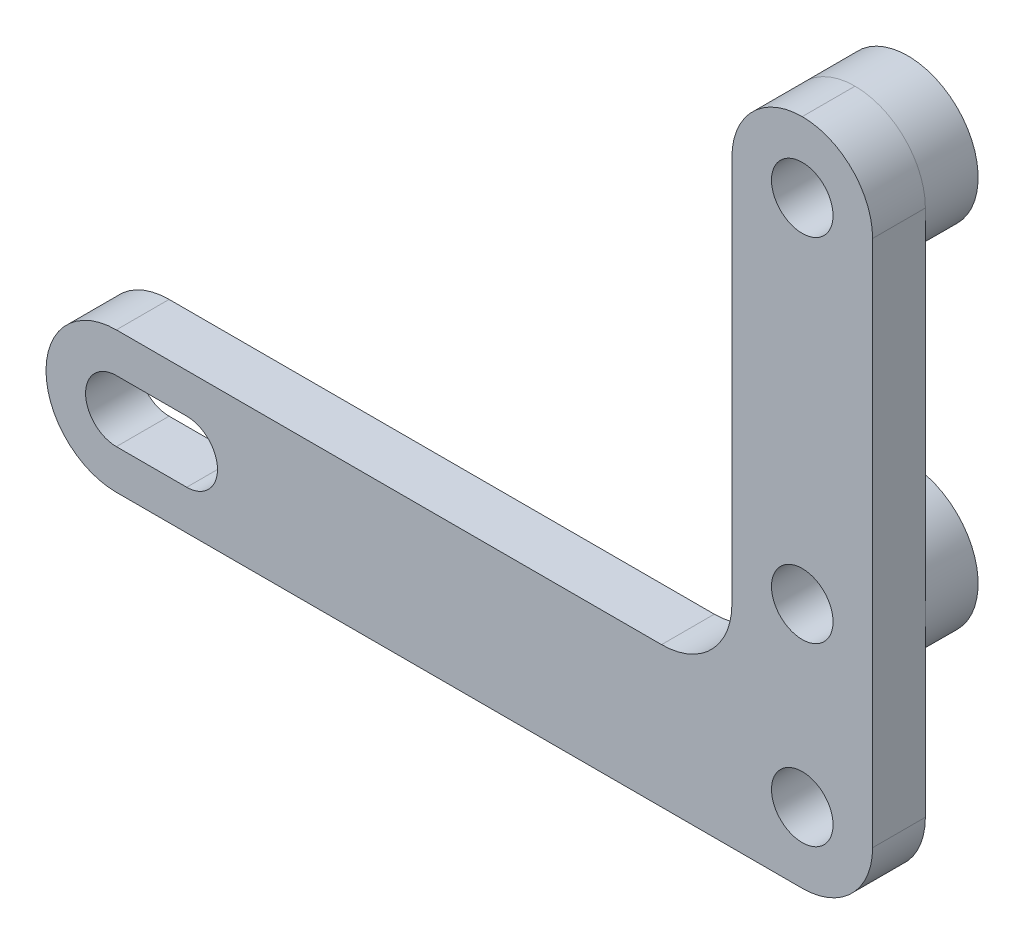
ISO-10303-21;
HEADER;
FILE_DESCRIPTION(('STEP AP214'),'2;1');
FILE_NAME('part.step','',(''),(''),'','','');
FILE_SCHEMA(('AUTOMOTIVE_DESIGN { 1 0 10303 214 1 1 1 1 }'));
ENDSEC;
DATA;
#1=APPLICATION_CONTEXT('core data for automotive mechanical design processes');
#2=APPLICATION_PROTOCOL_DEFINITION('international standard','automotive_design',2000,#1);
#3=PRODUCT_CONTEXT('',#1,'mechanical');
#4=PRODUCT('Part','Part','',(#3));
#5=PRODUCT_RELATED_PRODUCT_CATEGORY('part','',(#4));
#6=PRODUCT_DEFINITION_FORMATION('','',#4);
#7=PRODUCT_DEFINITION_CONTEXT('part definition',#1,'design');
#8=PRODUCT_DEFINITION('design','',#6,#7);
#9=PRODUCT_DEFINITION_SHAPE('','',#8);
#10=(LENGTH_UNIT() NAMED_UNIT(*) SI_UNIT(.MILLI.,.METRE.));
#11=(NAMED_UNIT(*) PLANE_ANGLE_UNIT() SI_UNIT($,.RADIAN.));
#12=(NAMED_UNIT(*) SI_UNIT($,.STERADIAN.) SOLID_ANGLE_UNIT());
#13=UNCERTAINTY_MEASURE_WITH_UNIT(LENGTH_MEASURE(1.E-05),#10,'distance_accuracy_value','');
#14=(GEOMETRIC_REPRESENTATION_CONTEXT(3) GLOBAL_UNCERTAINTY_ASSIGNED_CONTEXT((#13)) GLOBAL_UNIT_ASSIGNED_CONTEXT((#10,
#11,#12)) REPRESENTATION_CONTEXT('',''));
#15=CARTESIAN_POINT('',(0.,0.,0.));
#16=DIRECTION('',(0.,0.,1.));
#17=DIRECTION('',(1.,0.,0.));
#18=AXIS2_PLACEMENT_3D('',#15,#16,#17);
#19=CARTESIAN_POINT('',(0.,0.,0.));
#20=DIRECTION('',(0.,0.,1.));
#21=DIRECTION('',(1.,0.,0.));
#22=AXIS2_PLACEMENT_3D('',#19,#20,#21);
#23=PLANE('',#22);
#24=CARTESIAN_POINT('',(0.,0.,0.));
#25=DIRECTION('',(0.,0.,1.));
#26=DIRECTION('',(1.,0.,0.));
#27=AXIS2_PLACEMENT_3D('',#24,#25,#26);
#28=CIRCLE('',#27,1.75);
#29=CARTESIAN_POINT('',(1.75,0.,0.));
#30=VERTEX_POINT('',#29);
#31=EDGE_CURVE('E193',#30,#30,#28,.T.);
#32=ORIENTED_EDGE('',*,*,#31,.T.);
#33=EDGE_LOOP('',(#32));
#34=FACE_BOUND('',#33,.T.);
#35=CARTESIAN_POINT('',(-39.,0.,0.));
#36=DIRECTION('',(0.,0.,1.));
#37=DIRECTION('',(1.,0.,0.));
#38=AXIS2_PLACEMENT_3D('',#35,#36,#37);
#39=CIRCLE('',#38,1.75);
#40=CARTESIAN_POINT('',(-39.,1.75,0.));
#41=VERTEX_POINT('',#40);
#42=CARTESIAN_POINT('',(-39.,-1.75,0.));
#43=VERTEX_POINT('',#42);
#44=EDGE_CURVE('E197',#41,#43,#39,.T.);
#45=ORIENTED_EDGE('',*,*,#44,.T.);
#46=DIRECTION('',(1.,0.,0.));
#47=VECTOR('',#46,1.);
#48=CARTESIAN_POINT('',(-39.,-1.75,0.));
#49=LINE('',#48,#47);
#50=CARTESIAN_POINT('',(-35.,-1.75,0.));
#51=VERTEX_POINT('',#50);
#52=EDGE_CURVE('E213',#43,#51,#49,.T.);
#53=ORIENTED_EDGE('',*,*,#52,.T.);
#54=CARTESIAN_POINT('',(-35.,0.,0.));
#55=DIRECTION('',(0.,0.,1.));
#56=DIRECTION('',(1.,0.,0.));
#57=AXIS2_PLACEMENT_3D('',#54,#55,#56);
#58=CIRCLE('',#57,1.75);
#59=CARTESIAN_POINT('',(-35.,1.75,0.));
#60=VERTEX_POINT('',#59);
#61=EDGE_CURVE('E216',#51,#60,#58,.T.);
#62=ORIENTED_EDGE('',*,*,#61,.T.);
#63=DIRECTION('',(-1.,0.,0.));
#64=VECTOR('',#63,1.);
#65=CARTESIAN_POINT('',(-39.,1.75,0.));
#66=LINE('',#65,#64);
#67=EDGE_CURVE('E203',#60,#41,#66,.T.);
#68=ORIENTED_EDGE('',*,*,#67,.T.);
#69=EDGE_LOOP('',(#45,#53,#62,#68));
#70=FACE_BOUND('',#69,.T.);
#71=DIRECTION('',(0.,1.,0.));
#72=VECTOR('',#71,1.);
#73=CARTESIAN_POINT('',(4.,34.,0.));
#74=LINE('',#73,#72);
#75=CARTESIAN_POINT('',(4.,0.,0.));
#76=VERTEX_POINT('',#75);
#77=CARTESIAN_POINT('',(4.,10.,0.));
#78=VERTEX_POINT('',#77);
#79=EDGE_CURVE('E141',#76,#78,#74,.T.);
#80=ORIENTED_EDGE('',*,*,#79,.F.);
#81=CARTESIAN_POINT('',(0.,0.,0.));
#82=DIRECTION('',(0.,0.,1.));
#83=DIRECTION('',(1.,0.,0.));
#84=AXIS2_PLACEMENT_3D('',#81,#82,#83);
#85=CIRCLE('',#84,4.);
#86=CARTESIAN_POINT('',(0.,-4.,0.));
#87=VERTEX_POINT('',#86);
#88=EDGE_CURVE('E262',#76,#87,#85,.F.);
#89=ORIENTED_EDGE('',*,*,#88,.T.);
#90=DIRECTION('',(1.,0.,0.));
#91=VECTOR('',#90,1.);
#92=CARTESIAN_POINT('',(4.,-4.,0.));
#93=LINE('',#92,#91);
#94=CARTESIAN_POINT('',(-39.,-4.,0.));
#95=VERTEX_POINT('',#94);
#96=EDGE_CURVE('E163',#95,#87,#93,.T.);
#97=ORIENTED_EDGE('',*,*,#96,.F.);
#98=CARTESIAN_POINT('',(-39.,0.,0.));
#99=DIRECTION('',(0.,0.,1.));
#100=DIRECTION('',(1.,0.,0.));
#101=AXIS2_PLACEMENT_3D('',#98,#99,#100);
#102=CIRCLE('',#101,4.);
#103=CARTESIAN_POINT('',(-43.,0.,0.));
#104=VERTEX_POINT('',#103);
#105=EDGE_CURVE('E260',#95,#104,#102,.F.);
#106=ORIENTED_EDGE('',*,*,#105,.T.);
#107=CARTESIAN_POINT('',(-39.,0.,0.));
#108=DIRECTION('',(0.,0.,1.));
#109=DIRECTION('',(1.,0.,0.));
#110=AXIS2_PLACEMENT_3D('',#107,#108,#109);
#111=CIRCLE('',#110,4.);
#112=CARTESIAN_POINT('',(-39.,4.,0.));
#113=VERTEX_POINT('',#112);
#114=EDGE_CURVE('E258',#104,#113,#111,.F.);
#115=ORIENTED_EDGE('',*,*,#114,.T.);
#116=DIRECTION('',(-1.,0.,0.));
#117=VECTOR('',#116,1.);
#118=CARTESIAN_POINT('',(-43.,4.,0.));
#119=LINE('',#118,#117);
#120=CARTESIAN_POINT('',(-8.,4.,0.));
#121=VERTEX_POINT('',#120);
#122=EDGE_CURVE('E241',#121,#113,#119,.T.);
#123=ORIENTED_EDGE('',*,*,#122,.F.);
#124=CARTESIAN_POINT('',(-8.,8.,0.));
#125=DIRECTION('',(0.,0.,1.));
#126=DIRECTION('',(1.,0.,0.));
#127=AXIS2_PLACEMENT_3D('',#124,#125,#126);
#128=CIRCLE('',#127,4.);
#129=CARTESIAN_POINT('',(-4.,8.00000000000001,0.));
#130=VERTEX_POINT('',#129);
#131=EDGE_CURVE('E42',#121,#130,#128,.T.);
#132=ORIENTED_EDGE('',*,*,#131,.T.);
#133=DIRECTION('',(0.,-1.,0.));
#134=VECTOR('',#133,1.);
#135=CARTESIAN_POINT('',(-4.,34.,0.));
#136=LINE('',#135,#134);
#137=CARTESIAN_POINT('',(-4.,10.,0.));
#138=VERTEX_POINT('',#137);
#139=EDGE_CURVE('E167',#138,#130,#136,.T.);
#140=ORIENTED_EDGE('',*,*,#139,.F.);
#141=CARTESIAN_POINT('',(0.,10.,0.));
#142=DIRECTION('',(0.,0.,-1.));
#143=DIRECTION('',(-1.,0.,0.));
#144=AXIS2_PLACEMENT_3D('',#141,#142,#143);
#145=CIRCLE('',#144,4.);
#146=EDGE_CURVE('E165',#78,#138,#145,.T.);
#147=ORIENTED_EDGE('',*,*,#146,.F.);
#148=EDGE_LOOP('',(#80,#89,#97,#106,#115,#123,#132,#140,#147));
#149=FACE_BOUND('',#148,.T.);
#150=ADVANCED_FACE('F33',(#34,#70,#149),#23,.F.);
#151=EDGE_CURVE('E158',#138,#78,#145,.T.);
#152=ORIENTED_EDGE('',*,*,#151,.F.);
#153=CARTESIAN_POINT('',(-4.,30.,0.));
#154=VERTEX_POINT('',#153);
#155=EDGE_CURVE('E240',#154,#138,#136,.T.);
#156=ORIENTED_EDGE('',*,*,#155,.F.);
#157=CARTESIAN_POINT('',(0.,30.,0.));
#158=DIRECTION('',(0.,0.,-1.));
#159=DIRECTION('',(-1.,0.,0.));
#160=AXIS2_PLACEMENT_3D('',#157,#158,#159);
#161=CIRCLE('',#160,4.);
#162=CARTESIAN_POINT('',(4.,30.,0.));
#163=VERTEX_POINT('',#162);
#164=EDGE_CURVE('E161',#163,#154,#161,.T.);
#165=ORIENTED_EDGE('',*,*,#164,.F.);
#166=EDGE_CURVE('E146',#78,#163,#74,.T.);
#167=ORIENTED_EDGE('',*,*,#166,.F.);
#168=EDGE_LOOP('',(#152,#156,#165,#167));
#169=FACE_BOUND('',#168,.T.);
#170=ADVANCED_FACE('F155',(#169),#23,.F.);
#171=CARTESIAN_POINT('',(0.,0.,3.));
#172=DIRECTION('',(0.,0.,1.));
#173=DIRECTION('',(1.,0.,0.));
#174=AXIS2_PLACEMENT_3D('',#171,#172,#173);
#175=PLANE('',#174);
#176=CARTESIAN_POINT('',(0.,30.,3.));
#177=DIRECTION('',(0.,0.,1.));
#178=DIRECTION('',(1.,0.,0.));
#179=AXIS2_PLACEMENT_3D('',#176,#177,#178);
#180=CIRCLE('',#179,1.75);
#181=CARTESIAN_POINT('',(1.75,30.,3.));
#182=VERTEX_POINT('',#181);
#183=EDGE_CURVE('E190',#182,#182,#180,.T.);
#184=ORIENTED_EDGE('',*,*,#183,.F.);
#185=EDGE_LOOP('',(#184));
#186=FACE_BOUND('',#185,.T.);
#187=DIRECTION('',(1.,0.,0.));
#188=VECTOR('',#187,1.);
#189=CARTESIAN_POINT('',(-39.,-1.75,3.));
#190=LINE('',#189,#188);
#191=CARTESIAN_POINT('',(-39.,-1.75,3.));
#192=VERTEX_POINT('',#191);
#193=CARTESIAN_POINT('',(-35.,-1.75,3.));
#194=VERTEX_POINT('',#193);
#195=EDGE_CURVE('E202',#192,#194,#190,.T.);
#196=ORIENTED_EDGE('',*,*,#195,.F.);
#197=CARTESIAN_POINT('',(-39.,0.,3.));
#198=DIRECTION('',(0.,0.,1.));
#199=DIRECTION('',(1.,0.,0.));
#200=AXIS2_PLACEMENT_3D('',#197,#198,#199);
#201=CIRCLE('',#200,1.75);
#202=CARTESIAN_POINT('',(-39.,1.75,3.));
#203=VERTEX_POINT('',#202);
#204=EDGE_CURVE('E200',#203,#192,#201,.T.);
#205=ORIENTED_EDGE('',*,*,#204,.F.);
#206=DIRECTION('',(-1.,0.,0.));
#207=VECTOR('',#206,1.);
#208=CARTESIAN_POINT('',(-39.,1.75,3.));
#209=LINE('',#208,#207);
#210=CARTESIAN_POINT('',(-35.,1.75,3.));
#211=VERTEX_POINT('',#210);
#212=EDGE_CURVE('E208',#211,#203,#209,.T.);
#213=ORIENTED_EDGE('',*,*,#212,.F.);
#214=CARTESIAN_POINT('',(-35.,0.,3.));
#215=DIRECTION('',(0.,0.,1.));
#216=DIRECTION('',(1.,0.,0.));
#217=AXIS2_PLACEMENT_3D('',#214,#215,#216);
#218=CIRCLE('',#217,1.75);
#219=EDGE_CURVE('E205',#194,#211,#218,.T.);
#220=ORIENTED_EDGE('',*,*,#219,.F.);
#221=EDGE_LOOP('',(#196,#205,#213,#220));
#222=FACE_BOUND('',#221,.T.);
#223=DIRECTION('',(1.,0.,0.));
#224=VECTOR('',#223,1.);
#225=CARTESIAN_POINT('',(4.,-4.,3.));
#226=LINE('',#225,#224);
#227=CARTESIAN_POINT('',(-39.,-4.,3.));
#228=VERTEX_POINT('',#227);
#229=CARTESIAN_POINT('',(0.,-4.,3.));
#230=VERTEX_POINT('',#229);
#231=EDGE_CURVE('E234',#228,#230,#226,.T.);
#232=ORIENTED_EDGE('',*,*,#231,.T.);
#233=CARTESIAN_POINT('',(0.,0.,3.));
#234=DIRECTION('',(0.,0.,1.));
#235=DIRECTION('',(1.,0.,0.));
#236=AXIS2_PLACEMENT_3D('',#233,#234,#235);
#237=CIRCLE('',#236,4.);
#238=CARTESIAN_POINT('',(4.,0.,3.));
#239=VERTEX_POINT('',#238);
#240=EDGE_CURVE('E275',#230,#239,#237,.T.);
#241=ORIENTED_EDGE('',*,*,#240,.T.);
#242=DIRECTION('',(0.,1.,0.));
#243=VECTOR('',#242,1.);
#244=CARTESIAN_POINT('',(4.,34.,3.));
#245=LINE('',#244,#243);
#246=CARTESIAN_POINT('',(4.,30.,3.));
#247=VERTEX_POINT('',#246);
#248=EDGE_CURVE('E237',#239,#247,#245,.T.);
#249=ORIENTED_EDGE('',*,*,#248,.T.);
#250=CARTESIAN_POINT('',(0.,30.,3.));
#251=DIRECTION('',(0.,0.,1.));
#252=DIRECTION('',(1.,0.,0.));
#253=AXIS2_PLACEMENT_3D('',#250,#251,#252);
#254=CIRCLE('',#253,4.);
#255=CARTESIAN_POINT('',(0.,34.,3.));
#256=VERTEX_POINT('',#255);
#257=EDGE_CURVE('E50',#247,#256,#254,.T.);
#258=ORIENTED_EDGE('',*,*,#257,.T.);
#259=CARTESIAN_POINT('',(0.,30.,3.));
#260=DIRECTION('',(0.,0.,1.));
#261=DIRECTION('',(1.,0.,0.));
#262=AXIS2_PLACEMENT_3D('',#259,#260,#261);
#263=CIRCLE('',#262,4.);
#264=CARTESIAN_POINT('',(-4.,30.,3.));
#265=VERTEX_POINT('',#264);
#266=EDGE_CURVE('E269',#256,#265,#263,.T.);
#267=ORIENTED_EDGE('',*,*,#266,.T.);
#268=DIRECTION('',(0.,-1.,0.));
#269=VECTOR('',#268,1.);
#270=CARTESIAN_POINT('',(-4.,34.,3.));
#271=LINE('',#270,#269);
#272=CARTESIAN_POINT('',(-4.,8.00000000000001,3.));
#273=VERTEX_POINT('',#272);
#274=EDGE_CURVE('E152',#265,#273,#271,.T.);
#275=ORIENTED_EDGE('',*,*,#274,.T.);
#276=CARTESIAN_POINT('',(-8.,8.,3.));
#277=DIRECTION('',(0.,0.,1.));
#278=DIRECTION('',(1.,0.,0.));
#279=AXIS2_PLACEMENT_3D('',#276,#277,#278);
#280=CIRCLE('',#279,4.);
#281=CARTESIAN_POINT('',(-8.,4.,3.));
#282=VERTEX_POINT('',#281);
#283=EDGE_CURVE('E11',#273,#282,#280,.F.);
#284=ORIENTED_EDGE('',*,*,#283,.T.);
#285=DIRECTION('',(-1.,0.,0.));
#286=VECTOR('',#285,1.);
#287=CARTESIAN_POINT('',(-43.,4.,3.));
#288=LINE('',#287,#286);
#289=CARTESIAN_POINT('',(-39.,4.,3.));
#290=VERTEX_POINT('',#289);
#291=EDGE_CURVE('E232',#282,#290,#288,.T.);
#292=ORIENTED_EDGE('',*,*,#291,.T.);
#293=CARTESIAN_POINT('',(-39.,0.,3.));
#294=DIRECTION('',(0.,0.,1.));
#295=DIRECTION('',(1.,0.,0.));
#296=AXIS2_PLACEMENT_3D('',#293,#294,#295);
#297=CIRCLE('',#296,4.);
#298=CARTESIAN_POINT('',(-43.,0.,3.));
#299=VERTEX_POINT('',#298);
#300=EDGE_CURVE('E57',#290,#299,#297,.T.);
#301=ORIENTED_EDGE('',*,*,#300,.T.);
#302=CARTESIAN_POINT('',(-39.,0.,3.));
#303=DIRECTION('',(0.,0.,1.));
#304=DIRECTION('',(1.,0.,0.));
#305=AXIS2_PLACEMENT_3D('',#302,#303,#304);
#306=CIRCLE('',#305,4.);
#307=EDGE_CURVE('E273',#299,#228,#306,.T.);
#308=ORIENTED_EDGE('',*,*,#307,.T.);
#309=EDGE_LOOP('',(#232,#241,#249,#258,#267,#275,#284,#292,#301,#308));
#310=FACE_BOUND('',#309,.T.);
#311=CARTESIAN_POINT('',(0.,0.,3.));
#312=DIRECTION('',(0.,0.,1.));
#313=DIRECTION('',(1.,0.,0.));
#314=AXIS2_PLACEMENT_3D('',#311,#312,#313);
#315=CIRCLE('',#314,1.75);
#316=CARTESIAN_POINT('',(1.75,0.,3.));
#317=VERTEX_POINT('',#316);
#318=EDGE_CURVE('E194',#317,#317,#315,.T.);
#319=ORIENTED_EDGE('',*,*,#318,.F.);
#320=EDGE_LOOP('',(#319));
#321=FACE_BOUND('',#320,.T.);
#322=CARTESIAN_POINT('',(0.,10.,3.));
#323=DIRECTION('',(0.,0.,1.));
#324=DIRECTION('',(1.,0.,0.));
#325=AXIS2_PLACEMENT_3D('',#322,#323,#324);
#326=CIRCLE('',#325,1.75);
#327=CARTESIAN_POINT('',(1.75,10.,3.));
#328=VERTEX_POINT('',#327);
#329=EDGE_CURVE('E185',#328,#328,#326,.T.);
#330=ORIENTED_EDGE('',*,*,#329,.F.);
#331=EDGE_LOOP('',(#330));
#332=FACE_BOUND('',#331,.T.);
#333=ADVANCED_FACE('F292',(#186,#222,#310,#321,#332),#175,.T.);
#334=CARTESIAN_POINT('',(-4.,34.,3.));
#335=DIRECTION('',(1.,0.,0.));
#336=DIRECTION('',(0.,1.,0.));
#337=AXIS2_PLACEMENT_3D('',#334,#335,#336);
#338=PLANE('',#337);
#339=ORIENTED_EDGE('',*,*,#139,.T.);
#340=DIRECTION('',(0.,0.,-1.));
#341=VECTOR('',#340,1.);
#342=CARTESIAN_POINT('',(-4.,8.,3.));
#343=LINE('',#342,#341);
#344=EDGE_CURVE('E253',#130,#273,#343,.F.);
#345=ORIENTED_EDGE('',*,*,#344,.T.);
#346=ORIENTED_EDGE('',*,*,#274,.F.);
#347=DIRECTION('',(0.,0.,-1.));
#348=VECTOR('',#347,1.);
#349=CARTESIAN_POINT('',(-4.,30.,3.));
#350=LINE('',#349,#348);
#351=EDGE_CURVE('E251',#265,#154,#350,.T.);
#352=ORIENTED_EDGE('',*,*,#351,.T.);
#353=ORIENTED_EDGE('',*,*,#155,.T.);
#354=EDGE_LOOP('',(#339,#345,#346,#352,#353));
#355=FACE_BOUND('',#354,.T.);
#356=ADVANCED_FACE('F296',(#355),#338,.F.);
#357=CARTESIAN_POINT('',(-43.,4.,3.));
#358=DIRECTION('',(0.,-1.,0.));
#359=DIRECTION('',(0.,0.,-1.));
#360=AXIS2_PLACEMENT_3D('',#357,#358,#359);
#361=PLANE('',#360);
#362=ORIENTED_EDGE('',*,*,#291,.F.);
#363=DIRECTION('',(0.,0.,-1.));
#364=VECTOR('',#363,1.);
#365=CARTESIAN_POINT('',(-8.,4.,0.));
#366=LINE('',#365,#364);
#367=EDGE_CURVE('E248',#282,#121,#366,.T.);
#368=ORIENTED_EDGE('',*,*,#367,.T.);
#369=ORIENTED_EDGE('',*,*,#122,.T.);
#370=DIRECTION('',(0.,0.,-1.));
#371=VECTOR('',#370,1.);
#372=CARTESIAN_POINT('',(-39.,4.,3.));
#373=LINE('',#372,#371);
#374=EDGE_CURVE('E246',#113,#290,#373,.F.);
#375=ORIENTED_EDGE('',*,*,#374,.T.);
#376=EDGE_LOOP('',(#362,#368,#369,#375));
#377=FACE_BOUND('',#376,.T.);
#378=ADVANCED_FACE('F303',(#377),#361,.F.);
#379=CARTESIAN_POINT('',(4.,-4.,3.));
#380=DIRECTION('',(0.,1.,0.));
#381=DIRECTION('',(0.,0.,1.));
#382=AXIS2_PLACEMENT_3D('',#379,#380,#381);
#383=PLANE('',#382);
#384=ORIENTED_EDGE('',*,*,#96,.T.);
#385=DIRECTION('',(0.,0.,-1.));
#386=VECTOR('',#385,1.);
#387=CARTESIAN_POINT('',(0.,-4.,3.));
#388=LINE('',#387,#386);
#389=EDGE_CURVE('E267',#87,#230,#388,.F.);
#390=ORIENTED_EDGE('',*,*,#389,.T.);
#391=ORIENTED_EDGE('',*,*,#231,.F.);
#392=DIRECTION('',(0.,0.,-1.));
#393=VECTOR('',#392,1.);
#394=CARTESIAN_POINT('',(-39.,-4.,3.));
#395=LINE('',#394,#393);
#396=EDGE_CURVE('E264',#228,#95,#395,.T.);
#397=ORIENTED_EDGE('',*,*,#396,.T.);
#398=EDGE_LOOP('',(#384,#390,#391,#397));
#399=FACE_BOUND('',#398,.T.);
#400=ADVANCED_FACE('F314',(#399),#383,.F.);
#401=CARTESIAN_POINT('',(4.,34.,3.));
#402=DIRECTION('',(-1.,0.,0.));
#403=DIRECTION('',(0.,-1.,0.));
#404=AXIS2_PLACEMENT_3D('',#401,#402,#403);
#405=PLANE('',#404);
#406=ORIENTED_EDGE('',*,*,#248,.F.);
#407=DIRECTION('',(0.,0.,-1.));
#408=VECTOR('',#407,1.);
#409=CARTESIAN_POINT('',(4.,0.,3.));
#410=LINE('',#409,#408);
#411=EDGE_CURVE('E149',#239,#76,#410,.T.);
#412=ORIENTED_EDGE('',*,*,#411,.T.);
#413=ORIENTED_EDGE('',*,*,#79,.T.);
#414=ORIENTED_EDGE('',*,*,#166,.T.);
#415=DIRECTION('',(0.,0.,-1.));
#416=VECTOR('',#415,1.);
#417=CARTESIAN_POINT('',(4.,30.,3.));
#418=LINE('',#417,#416);
#419=EDGE_CURVE('E255',#163,#247,#418,.F.);
#420=ORIENTED_EDGE('',*,*,#419,.T.);
#421=EDGE_LOOP('',(#406,#412,#413,#414,#420));
#422=FACE_BOUND('',#421,.T.);
#423=ADVANCED_FACE('F144',(#422),#405,.F.);
#424=CARTESIAN_POINT('',(-39.,0.,3.));
#425=DIRECTION('',(0.,0.,-1.));
#426=DIRECTION('',(-1.,0.,0.));
#427=AXIS2_PLACEMENT_3D('',#424,#425,#426);
#428=CYLINDRICAL_SURFACE('',#427,1.75);
#429=ORIENTED_EDGE('',*,*,#44,.F.);
#430=DIRECTION('',(0.,0.,-1.));
#431=VECTOR('',#430,1.);
#432=CARTESIAN_POINT('',(-39.,1.75,3.));
#433=LINE('',#432,#431);
#434=EDGE_CURVE('E210',#203,#41,#433,.T.);
#435=ORIENTED_EDGE('',*,*,#434,.F.);
#436=ORIENTED_EDGE('',*,*,#204,.T.);
#437=DIRECTION('',(0.,0.,-1.));
#438=VECTOR('',#437,1.);
#439=CARTESIAN_POINT('',(-39.,-1.75,3.));
#440=LINE('',#439,#438);
#441=EDGE_CURVE('E227',#192,#43,#440,.T.);
#442=ORIENTED_EDGE('',*,*,#441,.T.);
#443=EDGE_LOOP('',(#429,#435,#436,#442));
#444=FACE_BOUND('',#443,.T.);
#445=ADVANCED_FACE('F340',(#444),#428,.F.);
#446=CARTESIAN_POINT('',(-39.,-1.75,3.));
#447=DIRECTION('',(0.,1.,0.));
#448=DIRECTION('',(0.,0.,1.));
#449=AXIS2_PLACEMENT_3D('',#446,#447,#448);
#450=PLANE('',#449);
#451=ORIENTED_EDGE('',*,*,#52,.F.);
#452=ORIENTED_EDGE('',*,*,#441,.F.);
#453=ORIENTED_EDGE('',*,*,#195,.T.);
#454=DIRECTION('',(0.,0.,-1.));
#455=VECTOR('',#454,1.);
#456=CARTESIAN_POINT('',(-35.,-1.75,3.));
#457=LINE('',#456,#455);
#458=EDGE_CURVE('E225',#194,#51,#457,.T.);
#459=ORIENTED_EDGE('',*,*,#458,.T.);
#460=EDGE_LOOP('',(#451,#452,#453,#459));
#461=FACE_BOUND('',#460,.T.);
#462=ADVANCED_FACE('F361',(#461),#450,.T.);
#463=CARTESIAN_POINT('',(-35.,0.,3.));
#464=DIRECTION('',(0.,0.,-1.));
#465=DIRECTION('',(-1.,0.,0.));
#466=AXIS2_PLACEMENT_3D('',#463,#464,#465);
#467=CYLINDRICAL_SURFACE('',#466,1.75);
#468=ORIENTED_EDGE('',*,*,#61,.F.);
#469=ORIENTED_EDGE('',*,*,#458,.F.);
#470=ORIENTED_EDGE('',*,*,#219,.T.);
#471=DIRECTION('',(0.,0.,-1.));
#472=VECTOR('',#471,1.);
#473=CARTESIAN_POINT('',(-35.,1.75,3.));
#474=LINE('',#473,#472);
#475=EDGE_CURVE('E223',#211,#60,#474,.T.);
#476=ORIENTED_EDGE('',*,*,#475,.T.);
#477=EDGE_LOOP('',(#468,#469,#470,#476));
#478=FACE_BOUND('',#477,.T.);
#479=ADVANCED_FACE('F364',(#478),#467,.F.);
#480=CARTESIAN_POINT('',(-39.,1.75,3.));
#481=DIRECTION('',(0.,-1.,0.));
#482=DIRECTION('',(0.,0.,-1.));
#483=AXIS2_PLACEMENT_3D('',#480,#481,#482);
#484=PLANE('',#483);
#485=ORIENTED_EDGE('',*,*,#67,.F.);
#486=ORIENTED_EDGE('',*,*,#475,.F.);
#487=ORIENTED_EDGE('',*,*,#212,.T.);
#488=ORIENTED_EDGE('',*,*,#434,.T.);
#489=EDGE_LOOP('',(#485,#486,#487,#488));
#490=FACE_BOUND('',#489,.T.);
#491=ADVANCED_FACE('F369',(#490),#484,.T.);
#492=CARTESIAN_POINT('',(0.,0.,3.));
#493=DIRECTION('',(0.,0.,-1.));
#494=DIRECTION('',(-1.,0.,0.));
#495=AXIS2_PLACEMENT_3D('',#492,#493,#494);
#496=CYLINDRICAL_SURFACE('',#495,1.75);
#497=ORIENTED_EDGE('',*,*,#318,.T.);
#498=EDGE_LOOP('',(#497));
#499=FACE_BOUND('',#498,.T.);
#500=ORIENTED_EDGE('',*,*,#31,.F.);
#501=EDGE_LOOP('',(#500));
#502=FACE_BOUND('',#501,.T.);
#503=ADVANCED_FACE('F371',(#499,#502),#496,.F.);
#504=CARTESIAN_POINT('',(0.,30.,3.));
#505=DIRECTION('',(0.,0.,-1.));
#506=DIRECTION('',(-1.,0.,0.));
#507=AXIS2_PLACEMENT_3D('',#504,#505,#506);
#508=CYLINDRICAL_SURFACE('',#507,1.75);
#509=ORIENTED_EDGE('',*,*,#183,.T.);
#510=EDGE_LOOP('',(#509));
#511=FACE_BOUND('',#510,.T.);
#512=CARTESIAN_POINT('',(0.,30.,-3.));
#513=DIRECTION('',(0.,0.,-1.));
#514=DIRECTION('',(-1.,0.,0.));
#515=AXIS2_PLACEMENT_3D('',#512,#513,#514);
#516=CIRCLE('',#515,1.75);
#517=CARTESIAN_POINT('',(-1.75,30.,-3.));
#518=VERTEX_POINT('',#517);
#519=EDGE_CURVE('E175',#518,#518,#516,.T.);
#520=ORIENTED_EDGE('',*,*,#519,.T.);
#521=EDGE_LOOP('',(#520));
#522=FACE_BOUND('',#521,.T.);
#523=ADVANCED_FACE('F377',(#511,#522),#508,.F.);
#524=CARTESIAN_POINT('',(0.,10.,3.));
#525=DIRECTION('',(0.,0.,-1.));
#526=DIRECTION('',(-1.,0.,0.));
#527=AXIS2_PLACEMENT_3D('',#524,#525,#526);
#528=CYLINDRICAL_SURFACE('',#527,1.75);
#529=ORIENTED_EDGE('',*,*,#329,.T.);
#530=EDGE_LOOP('',(#529));
#531=FACE_BOUND('',#530,.T.);
#532=CARTESIAN_POINT('',(0.,10.,-3.));
#533=DIRECTION('',(0.,0.,-1.));
#534=DIRECTION('',(-1.,0.,0.));
#535=AXIS2_PLACEMENT_3D('',#532,#533,#534);
#536=CIRCLE('',#535,1.75);
#537=CARTESIAN_POINT('',(-1.75,10.,-3.));
#538=VERTEX_POINT('',#537);
#539=EDGE_CURVE('E170',#538,#538,#536,.T.);
#540=ORIENTED_EDGE('',*,*,#539,.T.);
#541=EDGE_LOOP('',(#540));
#542=FACE_BOUND('',#541,.T.);
#543=ADVANCED_FACE('F417',(#531,#542),#528,.F.);
#544=CARTESIAN_POINT('',(0.,30.,-3.));
#545=DIRECTION('',(0.,0.,-1.));
#546=DIRECTION('',(-1.,0.,0.));
#547=AXIS2_PLACEMENT_3D('',#544,#545,#546);
#548=PLANE('',#547);
#549=CARTESIAN_POINT('',(0.,30.,-3.));
#550=DIRECTION('',(0.,0.,-1.));
#551=DIRECTION('',(-1.,0.,0.));
#552=AXIS2_PLACEMENT_3D('',#549,#550,#551);
#553=CIRCLE('',#552,4.);
#554=CARTESIAN_POINT('',(-4.,30.,-3.));
#555=VERTEX_POINT('',#554);
#556=EDGE_CURVE('E182',#555,#555,#553,.T.);
#557=ORIENTED_EDGE('',*,*,#556,.T.);
#558=EDGE_LOOP('',(#557));
#559=FACE_BOUND('',#558,.T.);
#560=ORIENTED_EDGE('',*,*,#519,.F.);
#561=EDGE_LOOP('',(#560));
#562=FACE_BOUND('',#561,.T.);
#563=ADVANCED_FACE('F427',(#559,#562),#548,.T.);
#564=CARTESIAN_POINT('',(0.,30.,-3.));
#565=DIRECTION('',(0.,0.,1.));
#566=DIRECTION('',(1.,0.,0.));
#567=AXIS2_PLACEMENT_3D('',#564,#565,#566);
#568=CYLINDRICAL_SURFACE('',#567,4.);
#569=ORIENTED_EDGE('',*,*,#556,.F.);
#570=EDGE_LOOP('',(#569));
#571=FACE_BOUND('',#570,.T.);
#572=CARTESIAN_POINT('',(0.,34.,0.));
#573=VERTEX_POINT('',#572);
#574=EDGE_CURVE('E181',#154,#573,#161,.T.);
#575=ORIENTED_EDGE('',*,*,#574,.T.);
#576=EDGE_CURVE('E187',#573,#163,#161,.T.);
#577=ORIENTED_EDGE('',*,*,#576,.T.);
#578=ORIENTED_EDGE('',*,*,#164,.T.);
#579=EDGE_LOOP('',(#575,#577,#578));
#580=FACE_BOUND('',#579,.T.);
#581=ADVANCED_FACE('F438',(#571,#580),#568,.T.);
#582=CARTESIAN_POINT('',(0.,10.,-3.));
#583=DIRECTION('',(0.,0.,-1.));
#584=DIRECTION('',(-1.,0.,0.));
#585=AXIS2_PLACEMENT_3D('',#582,#583,#584);
#586=PLANE('',#585);
#587=CARTESIAN_POINT('',(0.,10.,-3.));
#588=DIRECTION('',(0.,0.,-1.));
#589=DIRECTION('',(-1.,0.,0.));
#590=AXIS2_PLACEMENT_3D('',#587,#588,#589);
#591=CIRCLE('',#590,4.);
#592=CARTESIAN_POINT('',(-4.,10.,-3.));
#593=VERTEX_POINT('',#592);
#594=EDGE_CURVE('E173',#593,#593,#591,.T.);
#595=ORIENTED_EDGE('',*,*,#594,.T.);
#596=EDGE_LOOP('',(#595));
#597=FACE_BOUND('',#596,.T.);
#598=ORIENTED_EDGE('',*,*,#539,.F.);
#599=EDGE_LOOP('',(#598));
#600=FACE_BOUND('',#599,.T.);
#601=ADVANCED_FACE('F446',(#597,#600),#586,.T.);
#602=CARTESIAN_POINT('',(0.,10.,-3.));
#603=DIRECTION('',(0.,0.,1.));
#604=DIRECTION('',(1.,0.,0.));
#605=AXIS2_PLACEMENT_3D('',#602,#603,#604);
#606=CYLINDRICAL_SURFACE('',#605,4.);
#607=ORIENTED_EDGE('',*,*,#594,.F.);
#608=EDGE_LOOP('',(#607));
#609=FACE_BOUND('',#608,.T.);
#610=ORIENTED_EDGE('',*,*,#151,.T.);
#611=ORIENTED_EDGE('',*,*,#146,.T.);
#612=EDGE_LOOP('',(#610,#611));
#613=FACE_BOUND('',#612,.T.);
#614=ADVANCED_FACE('F172',(#609,#613),#606,.T.);
#615=CARTESIAN_POINT('',(-8.,8.,3.));
#616=DIRECTION('',(0.,0.,1.));
#617=DIRECTION('',(1.,0.,0.));
#618=AXIS2_PLACEMENT_3D('',#615,#616,#617);
#619=CYLINDRICAL_SURFACE('',#618,4.);
#620=ORIENTED_EDGE('',*,*,#283,.F.);
#621=ORIENTED_EDGE('',*,*,#344,.F.);
#622=ORIENTED_EDGE('',*,*,#131,.F.);
#623=ORIENTED_EDGE('',*,*,#367,.F.);
#624=EDGE_LOOP('',(#620,#621,#622,#623));
#625=FACE_BOUND('',#624,.T.);
#626=ADVANCED_FACE('F299',(#625),#619,.F.);
#627=CARTESIAN_POINT('',(0.,0.,3.));
#628=DIRECTION('',(0.,0.,-1.));
#629=DIRECTION('',(-1.,0.,0.));
#630=AXIS2_PLACEMENT_3D('',#627,#628,#629);
#631=CYLINDRICAL_SURFACE('',#630,4.);
#632=ORIENTED_EDGE('',*,*,#240,.F.);
#633=ORIENTED_EDGE('',*,*,#389,.F.);
#634=ORIENTED_EDGE('',*,*,#88,.F.);
#635=ORIENTED_EDGE('',*,*,#411,.F.);
#636=EDGE_LOOP('',(#632,#633,#634,#635));
#637=FACE_BOUND('',#636,.T.);
#638=ADVANCED_FACE('F318',(#637),#631,.T.);
#639=CARTESIAN_POINT('',(-39.,0.,3.));
#640=DIRECTION('',(0.,0.,-1.));
#641=DIRECTION('',(-1.,0.,0.));
#642=AXIS2_PLACEMENT_3D('',#639,#640,#641);
#643=CYLINDRICAL_SURFACE('',#642,4.);
#644=DIRECTION('',(0.,0.,-1.));
#645=VECTOR('',#644,1.);
#646=CARTESIAN_POINT('',(-43.,0.,3.));
#647=LINE('',#646,#645);
#648=EDGE_CURVE('E277',#299,#104,#647,.T.);
#649=ORIENTED_EDGE('',*,*,#648,.F.);
#650=ORIENTED_EDGE('',*,*,#300,.F.);
#651=ORIENTED_EDGE('',*,*,#374,.F.);
#652=ORIENTED_EDGE('',*,*,#114,.F.);
#653=EDGE_LOOP('',(#649,#650,#651,#652));
#654=FACE_BOUND('',#653,.T.);
#655=ADVANCED_FACE('F308',(#654),#643,.T.);
#656=CARTESIAN_POINT('',(-39.,0.,3.));
#657=DIRECTION('',(0.,0.,-1.));
#658=DIRECTION('',(-1.,0.,0.));
#659=AXIS2_PLACEMENT_3D('',#656,#657,#658);
#660=CYLINDRICAL_SURFACE('',#659,4.);
#661=ORIENTED_EDGE('',*,*,#307,.F.);
#662=ORIENTED_EDGE('',*,*,#648,.T.);
#663=ORIENTED_EDGE('',*,*,#105,.F.);
#664=ORIENTED_EDGE('',*,*,#396,.F.);
#665=EDGE_LOOP('',(#661,#662,#663,#664));
#666=FACE_BOUND('',#665,.T.);
#667=ADVANCED_FACE('F310',(#666),#660,.T.);
#668=CARTESIAN_POINT('',(0.,30.,3.));
#669=DIRECTION('',(0.,0.,-1.));
#670=DIRECTION('',(-1.,0.,0.));
#671=AXIS2_PLACEMENT_3D('',#668,#669,#670);
#672=CYLINDRICAL_SURFACE('',#671,4.);
#673=ORIENTED_EDGE('',*,*,#351,.F.);
#674=ORIENTED_EDGE('',*,*,#266,.F.);
#675=DIRECTION('',(0.,0.,-1.));
#676=VECTOR('',#675,1.);
#677=CARTESIAN_POINT('',(0.,34.,3.));
#678=LINE('',#677,#676);
#679=EDGE_CURVE('E37',#573,#256,#678,.F.);
#680=ORIENTED_EDGE('',*,*,#679,.F.);
#681=ORIENTED_EDGE('',*,*,#574,.F.);
#682=EDGE_LOOP('',(#673,#674,#680,#681));
#683=FACE_BOUND('',#682,.T.);
#684=ADVANCED_FACE('F35',(#683),#672,.T.);
#685=CARTESIAN_POINT('',(0.,30.,3.));
#686=DIRECTION('',(0.,0.,-1.));
#687=DIRECTION('',(-1.,0.,0.));
#688=AXIS2_PLACEMENT_3D('',#685,#686,#687);
#689=CYLINDRICAL_SURFACE('',#688,4.);
#690=ORIENTED_EDGE('',*,*,#257,.F.);
#691=ORIENTED_EDGE('',*,*,#419,.F.);
#692=ORIENTED_EDGE('',*,*,#576,.F.);
#693=ORIENTED_EDGE('',*,*,#679,.T.);
#694=EDGE_LOOP('',(#690,#691,#692,#693));
#695=FACE_BOUND('',#694,.T.);
#696=ADVANCED_FACE('F286',(#695),#689,.T.);
#697=CLOSED_SHELL('',(#150,#170,#333,#356,#378,#400,#423,#445,#462,#479,#491,#503,#523,#543,
#563,#581,#601,#614,#626,#638,#655,#667,#684,#696));
#698=MANIFOLD_SOLID_BREP('B2',#697);
#699=ADVANCED_BREP_SHAPE_REPRESENTATION('',(#18,#698),#14);
#700=SHAPE_DEFINITION_REPRESENTATION(#9,#699);
ENDSEC;
END-ISO-10303-21;
